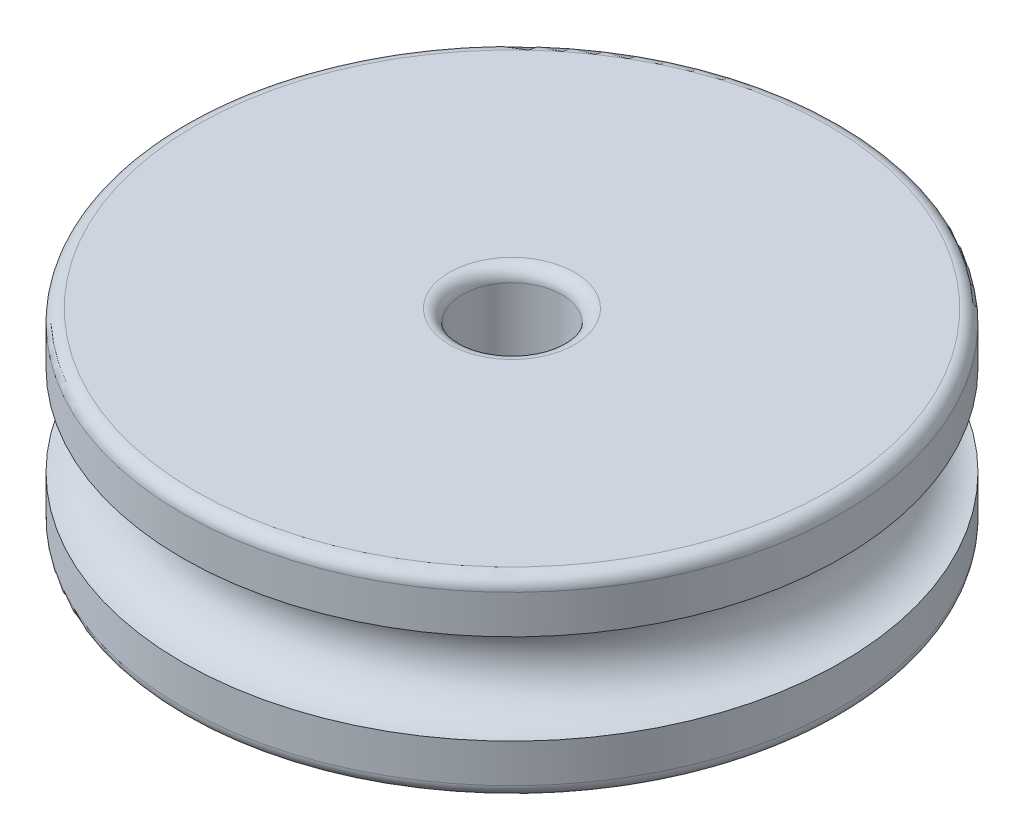
ISO-10303-21;
HEADER;
FILE_DESCRIPTION(('STEP AP214'),'2;1');
FILE_NAME('part.step','',(''),(''),'','','');
FILE_SCHEMA(('AUTOMOTIVE_DESIGN { 1 0 10303 214 1 1 1 1 }'));
ENDSEC;
DATA;
#1=APPLICATION_CONTEXT('core data for automotive mechanical design processes');
#2=APPLICATION_PROTOCOL_DEFINITION('international standard','automotive_design',2000,#1);
#3=PRODUCT_CONTEXT('',#1,'mechanical');
#4=PRODUCT('Part','Part','',(#3));
#5=PRODUCT_RELATED_PRODUCT_CATEGORY('part','',(#4));
#6=PRODUCT_DEFINITION_FORMATION('','',#4);
#7=PRODUCT_DEFINITION_CONTEXT('part definition',#1,'design');
#8=PRODUCT_DEFINITION('design','',#6,#7);
#9=PRODUCT_DEFINITION_SHAPE('','',#8);
#10=(LENGTH_UNIT() NAMED_UNIT(*) SI_UNIT(.MILLI.,.METRE.));
#11=(NAMED_UNIT(*) PLANE_ANGLE_UNIT() SI_UNIT($,.RADIAN.));
#12=(NAMED_UNIT(*) SI_UNIT($,.STERADIAN.) SOLID_ANGLE_UNIT());
#13=UNCERTAINTY_MEASURE_WITH_UNIT(LENGTH_MEASURE(1.E-05),#10,'distance_accuracy_value','');
#14=(GEOMETRIC_REPRESENTATION_CONTEXT(3) GLOBAL_UNCERTAINTY_ASSIGNED_CONTEXT((#13)) GLOBAL_UNIT_ASSIGNED_CONTEXT((#10,
#11,#12)) REPRESENTATION_CONTEXT('',''));
#15=CARTESIAN_POINT('',(0.,0.,0.));
#16=DIRECTION('',(0.,0.,1.));
#17=DIRECTION('',(1.,0.,0.));
#18=AXIS2_PLACEMENT_3D('',#15,#16,#17);
#19=CARTESIAN_POINT('',(0.,-7.5,0.));
#20=DIRECTION('',(0.,1.,0.));
#21=DIRECTION('',(0.,0.,1.));
#22=AXIS2_PLACEMENT_3D('',#19,#20,#21);
#23=CYLINDRICAL_SURFACE('',#22,25.58);
#24=CARTESIAN_POINT('',(0.,6.5,0.));
#25=DIRECTION('',(0.,1.,0.));
#26=DIRECTION('',(0.,0.,1.));
#27=AXIS2_PLACEMENT_3D('',#24,#25,#26);
#28=CIRCLE('',#27,25.58);
#29=CARTESIAN_POINT('',(0.,6.5,25.58));
#30=VERTEX_POINT('',#29);
#31=EDGE_CURVE('E11',#30,#30,#28,.F.);
#32=ORIENTED_EDGE('',*,*,#31,.T.);
#33=EDGE_LOOP('',(#32));
#34=FACE_BOUND('',#33,.T.);
#35=CARTESIAN_POINT('',(0.,3.505,0.));
#36=DIRECTION('',(0.,-1.,0.));
#37=DIRECTION('',(0.,0.,-1.));
#38=AXIS2_PLACEMENT_3D('',#35,#36,#37);
#39=CIRCLE('',#38,25.58);
#40=CARTESIAN_POINT('',(-25.58,3.505,0.));
#41=VERTEX_POINT('',#40);
#42=EDGE_CURVE('E65',#41,#41,#39,.T.);
#43=ORIENTED_EDGE('',*,*,#42,.F.);
#44=EDGE_LOOP('',(#43));
#45=FACE_BOUND('',#44,.T.);
#46=ADVANCED_FACE('F45',(#34,#45),#23,.T.);
#47=CARTESIAN_POINT('',(0.,-7.5,0.));
#48=DIRECTION('',(0.,1.,0.));
#49=DIRECTION('',(0.,0.,1.));
#50=AXIS2_PLACEMENT_3D('',#47,#48,#49);
#51=CYLINDRICAL_SURFACE('',#50,3.86);
#52=CARTESIAN_POINT('',(0.,6.5,0.));
#53=DIRECTION('',(0.,1.,0.));
#54=DIRECTION('',(0.,0.,1.));
#55=AXIS2_PLACEMENT_3D('',#52,#53,#54);
#56=CIRCLE('',#55,3.86);
#57=CARTESIAN_POINT('',(0.,6.5,3.86));
#58=VERTEX_POINT('',#57);
#59=EDGE_CURVE('E73',#58,#58,#56,.T.);
#60=ORIENTED_EDGE('',*,*,#59,.T.);
#61=EDGE_LOOP('',(#60));
#62=FACE_BOUND('',#61,.T.);
#63=CARTESIAN_POINT('',(0.,-6.5,0.));
#64=DIRECTION('',(0.,1.,0.));
#65=DIRECTION('',(0.,0.,1.));
#66=AXIS2_PLACEMENT_3D('',#63,#64,#65);
#67=CIRCLE('',#66,3.86);
#68=CARTESIAN_POINT('',(0.,-6.5,3.86));
#69=VERTEX_POINT('',#68);
#70=EDGE_CURVE('E70',#69,#69,#67,.F.);
#71=ORIENTED_EDGE('',*,*,#70,.T.);
#72=EDGE_LOOP('',(#71));
#73=FACE_BOUND('',#72,.T.);
#74=ADVANCED_FACE('F107',(#62,#73),#51,.F.);
#75=CARTESIAN_POINT('',(0.,-6.5,0.));
#76=DIRECTION('',(0.,1.,0.));
#77=DIRECTION('',(0.,0.,1.));
#78=AXIS2_PLACEMENT_3D('',#75,#76,#77);
#79=CIRCLE('',#78,25.58);
#80=CARTESIAN_POINT('',(0.,-6.5,25.58));
#81=VERTEX_POINT('',#80);
#82=EDGE_CURVE('E53',#81,#81,#79,.T.);
#83=ORIENTED_EDGE('',*,*,#82,.T.);
#84=EDGE_LOOP('',(#83));
#85=FACE_BOUND('',#84,.T.);
#86=CARTESIAN_POINT('',(0.,-3.505,0.));
#87=DIRECTION('',(0.,1.,0.));
#88=DIRECTION('',(0.,0.,1.));
#89=AXIS2_PLACEMENT_3D('',#86,#87,#88);
#90=CIRCLE('',#89,25.58);
#91=CARTESIAN_POINT('',(-25.58,-3.505,0.));
#92=VERTEX_POINT('',#91);
#93=EDGE_CURVE('E63',#92,#92,#90,.T.);
#94=ORIENTED_EDGE('',*,*,#93,.F.);
#95=EDGE_LOOP('',(#94));
#96=FACE_BOUND('',#95,.T.);
#97=ADVANCED_FACE('F90',(#85,#96),#23,.T.);
#98=CARTESIAN_POINT('',(0.,-7.5,0.));
#99=DIRECTION('',(0.,1.,0.));
#100=DIRECTION('',(0.,0.,1.));
#101=AXIS2_PLACEMENT_3D('',#98,#99,#100);
#102=PLANE('',#101);
#103=CARTESIAN_POINT('',(0.,-7.5,0.));
#104=DIRECTION('',(0.,1.,0.));
#105=DIRECTION('',(0.,0.,1.));
#106=AXIS2_PLACEMENT_3D('',#103,#104,#105);
#107=CIRCLE('',#106,4.86);
#108=CARTESIAN_POINT('',(0.,-7.5,4.86));
#109=VERTEX_POINT('',#108);
#110=EDGE_CURVE('E85',#109,#109,#107,.T.);
#111=ORIENTED_EDGE('',*,*,#110,.T.);
#112=EDGE_LOOP('',(#111));
#113=FACE_BOUND('',#112,.T.);
#114=CARTESIAN_POINT('',(0.,-7.5,0.));
#115=DIRECTION('',(0.,1.,0.));
#116=DIRECTION('',(0.,0.,1.));
#117=AXIS2_PLACEMENT_3D('',#114,#115,#116);
#118=CIRCLE('',#117,24.58);
#119=CARTESIAN_POINT('',(0.,-7.5,24.58));
#120=VERTEX_POINT('',#119);
#121=EDGE_CURVE('E82',#120,#120,#118,.F.);
#122=ORIENTED_EDGE('',*,*,#121,.T.);
#123=EDGE_LOOP('',(#122));
#124=FACE_BOUND('',#123,.T.);
#125=ADVANCED_FACE('F118',(#113,#124),#102,.F.);
#126=CARTESIAN_POINT('',(0.,7.5,0.));
#127=DIRECTION('',(0.,1.,0.));
#128=DIRECTION('',(0.,0.,1.));
#129=AXIS2_PLACEMENT_3D('',#126,#127,#128);
#130=PLANE('',#129);
#131=CARTESIAN_POINT('',(0.,7.5,0.));
#132=DIRECTION('',(0.,1.,0.));
#133=DIRECTION('',(0.,0.,1.));
#134=AXIS2_PLACEMENT_3D('',#131,#132,#133);
#135=CIRCLE('',#134,4.86);
#136=CARTESIAN_POINT('',(0.,7.5,4.86));
#137=VERTEX_POINT('',#136);
#138=EDGE_CURVE('E79',#137,#137,#135,.F.);
#139=ORIENTED_EDGE('',*,*,#138,.T.);
#140=EDGE_LOOP('',(#139));
#141=FACE_BOUND('',#140,.T.);
#142=CARTESIAN_POINT('',(0.,7.5,0.));
#143=DIRECTION('',(0.,1.,0.));
#144=DIRECTION('',(0.,0.,1.));
#145=AXIS2_PLACEMENT_3D('',#142,#143,#144);
#146=CIRCLE('',#145,24.58);
#147=CARTESIAN_POINT('',(0.,7.5,24.58));
#148=VERTEX_POINT('',#147);
#149=EDGE_CURVE('E76',#148,#148,#146,.T.);
#150=ORIENTED_EDGE('',*,*,#149,.T.);
#151=EDGE_LOOP('',(#150));
#152=FACE_BOUND('',#151,.T.);
#153=ADVANCED_FACE('F122',(#141,#152),#130,.T.);
#154=CARTESIAN_POINT('',(0.,0.,0.));
#155=DIRECTION('',(0.,1.,0.));
#156=DIRECTION('',(0.,0.,1.));
#157=AXIS2_PLACEMENT_3D('',#154,#155,#156);
#158=TOROIDAL_SURFACE('',#157,25.58,3.505);
#159=ORIENTED_EDGE('',*,*,#42,.T.);
#160=CARTESIAN_POINT('',(-25.58,0.,0.));
#161=DIRECTION('',(0.,0.,1.));
#162=DIRECTION('',(1.,0.,0.));
#163=AXIS2_PLACEMENT_3D('',#160,#161,#162);
#164=CIRCLE('',#163,3.505);
#165=EDGE_CURVE('E60',#92,#41,#164,.T.);
#166=ORIENTED_EDGE('',*,*,#165,.F.);
#167=ORIENTED_EDGE('',*,*,#93,.T.);
#168=ORIENTED_EDGE('',*,*,#165,.T.);
#169=EDGE_LOOP('',(#159,#166,#167,#168));
#170=FACE_BOUND('',#169,.T.);
#171=ADVANCED_FACE('F61',(#170),#158,.F.);
#172=CARTESIAN_POINT('',(0.,6.5,0.));
#173=DIRECTION('',(0.,1.,0.));
#174=DIRECTION('',(0.,0.,1.));
#175=AXIS2_PLACEMENT_3D('',#172,#173,#174);
#176=TOROIDAL_SURFACE('',#175,4.86,1.);
#177=ORIENTED_EDGE('',*,*,#138,.F.);
#178=EDGE_LOOP('',(#177));
#179=FACE_BOUND('',#178,.T.);
#180=ORIENTED_EDGE('',*,*,#59,.F.);
#181=EDGE_LOOP('',(#180));
#182=FACE_BOUND('',#181,.T.);
#183=ADVANCED_FACE('F102',(#179,#182),#176,.T.);
#184=CARTESIAN_POINT('',(0.,-6.5,0.));
#185=DIRECTION('',(0.,1.,0.));
#186=DIRECTION('',(0.,0.,1.));
#187=AXIS2_PLACEMENT_3D('',#184,#185,#186);
#188=TOROIDAL_SURFACE('',#187,4.86,1.);
#189=ORIENTED_EDGE('',*,*,#70,.F.);
#190=EDGE_LOOP('',(#189));
#191=FACE_BOUND('',#190,.T.);
#192=ORIENTED_EDGE('',*,*,#110,.F.);
#193=EDGE_LOOP('',(#192));
#194=FACE_BOUND('',#193,.T.);
#195=ADVANCED_FACE('F95',(#191,#194),#188,.T.);
#196=CARTESIAN_POINT('',(0.,-6.5,0.));
#197=DIRECTION('',(0.,1.,0.));
#198=DIRECTION('',(0.,0.,1.));
#199=AXIS2_PLACEMENT_3D('',#196,#197,#198);
#200=TOROIDAL_SURFACE('',#199,24.58,1.);
#201=ORIENTED_EDGE('',*,*,#121,.F.);
#202=EDGE_LOOP('',(#201));
#203=FACE_BOUND('',#202,.T.);
#204=ORIENTED_EDGE('',*,*,#82,.F.);
#205=EDGE_LOOP('',(#204));
#206=FACE_BOUND('',#205,.T.);
#207=ADVANCED_FACE('F93',(#203,#206),#200,.T.);
#208=CARTESIAN_POINT('',(0.,6.5,0.));
#209=DIRECTION('',(0.,1.,0.));
#210=DIRECTION('',(0.,0.,1.));
#211=AXIS2_PLACEMENT_3D('',#208,#209,#210);
#212=TOROIDAL_SURFACE('',#211,24.58,1.);
#213=ORIENTED_EDGE('',*,*,#31,.F.);
#214=EDGE_LOOP('',(#213));
#215=FACE_BOUND('',#214,.T.);
#216=ORIENTED_EDGE('',*,*,#149,.F.);
#217=EDGE_LOOP('',(#216));
#218=FACE_BOUND('',#217,.T.);
#219=ADVANCED_FACE('F47',(#215,#218),#212,.T.);
#220=CLOSED_SHELL('',(#46,#74,#97,#125,#153,#171,#183,#195,#207,#219));
#221=MANIFOLD_SOLID_BREP('B2',#220);
#222=ADVANCED_BREP_SHAPE_REPRESENTATION('',(#18,#221),#14);
#223=SHAPE_DEFINITION_REPRESENTATION(#9,#222);
ENDSEC;
END-ISO-10303-21;
